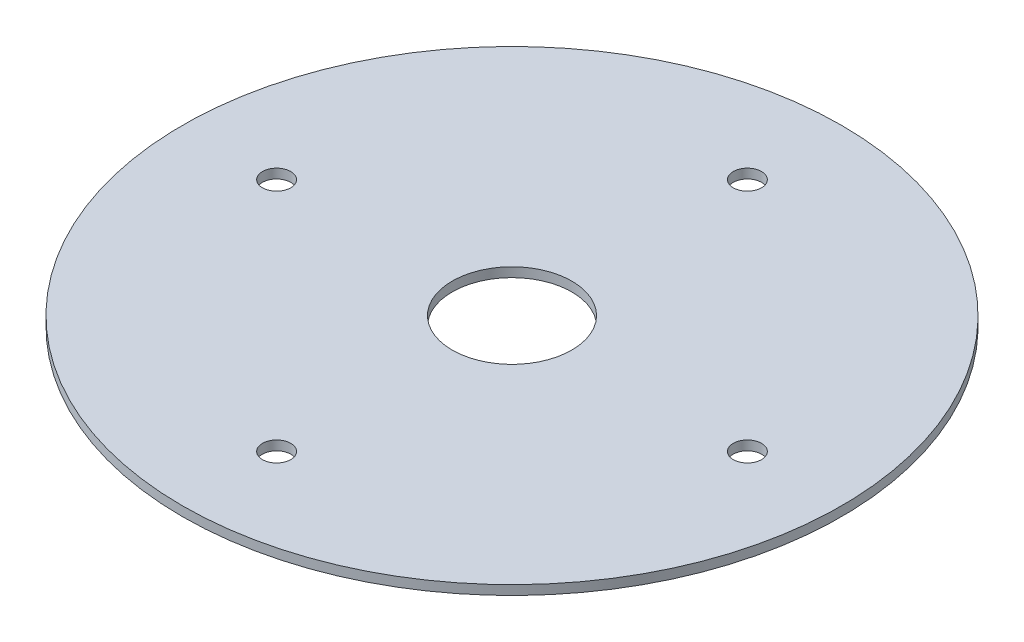
ISO-10303-21;
HEADER;
FILE_DESCRIPTION(('STEP AP214'),'2;1');
FILE_NAME('part.step','',(''),(''),'','','');
FILE_SCHEMA(('AUTOMOTIVE_DESIGN { 1 0 10303 214 1 1 1 1 }'));
ENDSEC;
DATA;
#1=APPLICATION_CONTEXT('core data for automotive mechanical design processes');
#2=APPLICATION_PROTOCOL_DEFINITION('international standard','automotive_design',2000,#1);
#3=PRODUCT_CONTEXT('',#1,'mechanical');
#4=PRODUCT('Part','Part','',(#3));
#5=PRODUCT_RELATED_PRODUCT_CATEGORY('part','',(#4));
#6=PRODUCT_DEFINITION_FORMATION('','',#4);
#7=PRODUCT_DEFINITION_CONTEXT('part definition',#1,'design');
#8=PRODUCT_DEFINITION('design','',#6,#7);
#9=PRODUCT_DEFINITION_SHAPE('','',#8);
#10=(LENGTH_UNIT() NAMED_UNIT(*) SI_UNIT(.MILLI.,.METRE.));
#11=(NAMED_UNIT(*) PLANE_ANGLE_UNIT() SI_UNIT($,.RADIAN.));
#12=(NAMED_UNIT(*) SI_UNIT($,.STERADIAN.) SOLID_ANGLE_UNIT());
#13=UNCERTAINTY_MEASURE_WITH_UNIT(LENGTH_MEASURE(1.E-05),#10,'distance_accuracy_value','');
#14=(GEOMETRIC_REPRESENTATION_CONTEXT(3) GLOBAL_UNCERTAINTY_ASSIGNED_CONTEXT((#13)) GLOBAL_UNIT_ASSIGNED_CONTEXT((#10,
#11,#12)) REPRESENTATION_CONTEXT('',''));
#15=CARTESIAN_POINT('',(0.,0.,0.));
#16=DIRECTION('',(0.,0.,1.));
#17=DIRECTION('',(1.,0.,0.));
#18=AXIS2_PLACEMENT_3D('',#15,#16,#17);
#19=CARTESIAN_POINT('',(0.,1.,0.));
#20=DIRECTION('',(0.,-1.,0.));
#21=DIRECTION('',(0.,0.,-1.));
#22=AXIS2_PLACEMENT_3D('',#19,#20,#21);
#23=CYLINDRICAL_SURFACE('',#22,35.);
#24=CARTESIAN_POINT('',(0.,1.,0.));
#25=DIRECTION('',(0.,1.,0.));
#26=DIRECTION('',(0.,0.,1.));
#27=AXIS2_PLACEMENT_3D('',#24,#25,#26);
#28=CIRCLE('',#27,35.);
#29=CARTESIAN_POINT('',(0.,1.,35.));
#30=VERTEX_POINT('',#29);
#31=EDGE_CURVE('E10',#30,#30,#28,.T.);
#32=ORIENTED_EDGE('',*,*,#31,.F.);
#33=EDGE_LOOP('',(#32));
#34=FACE_BOUND('',#33,.T.);
#35=CARTESIAN_POINT('',(0.,0.,0.));
#36=DIRECTION('',(0.,1.,0.));
#37=DIRECTION('',(0.,0.,1.));
#38=AXIS2_PLACEMENT_3D('',#35,#36,#37);
#39=CIRCLE('',#38,35.);
#40=CARTESIAN_POINT('',(0.,0.,35.));
#41=VERTEX_POINT('',#40);
#42=EDGE_CURVE('E44',#41,#41,#39,.T.);
#43=ORIENTED_EDGE('',*,*,#42,.T.);
#44=EDGE_LOOP('',(#43));
#45=FACE_BOUND('',#44,.T.);
#46=ADVANCED_FACE('F41',(#34,#45),#23,.T.);
#47=CARTESIAN_POINT('',(0.,1.,0.));
#48=DIRECTION('',(0.,1.,0.));
#49=DIRECTION('',(0.,0.,1.));
#50=AXIS2_PLACEMENT_3D('',#47,#48,#49);
#51=PLANE('',#50);
#52=CARTESIAN_POINT('',(25.,1.,0.));
#53=DIRECTION('',(0.,1.,0.));
#54=DIRECTION('',(-1.,0.,0.));
#55=AXIS2_PLACEMENT_3D('',#52,#53,#54);
#56=CIRCLE('',#55,1.5);
#57=CARTESIAN_POINT('',(23.5,1.,0.));
#58=VERTEX_POINT('',#57);
#59=EDGE_CURVE('E87',#58,#58,#56,.T.);
#60=ORIENTED_EDGE('',*,*,#59,.F.);
#61=EDGE_LOOP('',(#60));
#62=FACE_BOUND('',#61,.T.);
#63=CARTESIAN_POINT('',(0.,1.,25.));
#64=DIRECTION('',(0.,1.,0.));
#65=DIRECTION('',(0.,0.,-1.));
#66=AXIS2_PLACEMENT_3D('',#63,#64,#65);
#67=CIRCLE('',#66,1.5);
#68=CARTESIAN_POINT('',(0.,1.,23.5));
#69=VERTEX_POINT('',#68);
#70=EDGE_CURVE('E79',#69,#69,#67,.T.);
#71=ORIENTED_EDGE('',*,*,#70,.F.);
#72=EDGE_LOOP('',(#71));
#73=FACE_BOUND('',#72,.T.);
#74=CARTESIAN_POINT('',(-25.,1.,-2.61861100413235E-13));
#75=DIRECTION('',(0.,1.,0.));
#76=DIRECTION('',(1.,0.,0.));
#77=AXIS2_PLACEMENT_3D('',#74,#75,#76);
#78=CIRCLE('',#77,1.5);
#79=CARTESIAN_POINT('',(-23.5,1.,-2.46149434388441E-13));
#80=VERTEX_POINT('',#79);
#81=EDGE_CURVE('E71',#80,#80,#78,.T.);
#82=ORIENTED_EDGE('',*,*,#81,.F.);
#83=EDGE_LOOP('',(#82));
#84=FACE_BOUND('',#83,.T.);
#85=CARTESIAN_POINT('',(0.,1.,-25.));
#86=DIRECTION('',(0.,1.,0.));
#87=DIRECTION('',(0.,0.,1.));
#88=AXIS2_PLACEMENT_3D('',#85,#86,#87);
#89=CIRCLE('',#88,1.5);
#90=CARTESIAN_POINT('',(0.,1.,-23.5));
#91=VERTEX_POINT('',#90);
#92=EDGE_CURVE('E63',#91,#91,#89,.T.);
#93=ORIENTED_EDGE('',*,*,#92,.F.);
#94=EDGE_LOOP('',(#93));
#95=FACE_BOUND('',#94,.T.);
#96=CARTESIAN_POINT('',(0.,1.,0.));
#97=DIRECTION('',(0.,1.,0.));
#98=DIRECTION('',(0.,0.,1.));
#99=AXIS2_PLACEMENT_3D('',#96,#97,#98);
#100=CIRCLE('',#99,6.35);
#101=CARTESIAN_POINT('',(0.,1.,6.35));
#102=VERTEX_POINT('',#101);
#103=EDGE_CURVE('E55',#102,#102,#100,.T.);
#104=ORIENTED_EDGE('',*,*,#103,.F.);
#105=EDGE_LOOP('',(#104));
#106=FACE_BOUND('',#105,.T.);
#107=ORIENTED_EDGE('',*,*,#31,.T.);
#108=EDGE_LOOP('',(#107));
#109=FACE_BOUND('',#108,.T.);
#110=ADVANCED_FACE('F105',(#62,#73,#84,#95,#106,#109),#51,.T.);
#111=CARTESIAN_POINT('',(0.,0.,0.));
#112=DIRECTION('',(0.,1.,0.));
#113=DIRECTION('',(0.,0.,1.));
#114=AXIS2_PLACEMENT_3D('',#111,#112,#113);
#115=PLANE('',#114);
#116=CARTESIAN_POINT('',(25.,0.,0.));
#117=DIRECTION('',(0.,1.,0.));
#118=DIRECTION('',(-1.,0.,0.));
#119=AXIS2_PLACEMENT_3D('',#116,#117,#118);
#120=CIRCLE('',#119,1.5);
#121=CARTESIAN_POINT('',(23.5,0.,0.));
#122=VERTEX_POINT('',#121);
#123=EDGE_CURVE('E67',#122,#122,#120,.T.);
#124=ORIENTED_EDGE('',*,*,#123,.T.);
#125=EDGE_LOOP('',(#124));
#126=FACE_BOUND('',#125,.T.);
#127=CARTESIAN_POINT('',(0.,0.,25.));
#128=DIRECTION('',(0.,1.,0.));
#129=DIRECTION('',(0.,0.,-1.));
#130=AXIS2_PLACEMENT_3D('',#127,#128,#129);
#131=CIRCLE('',#130,1.5);
#132=CARTESIAN_POINT('',(0.,0.,23.5));
#133=VERTEX_POINT('',#132);
#134=EDGE_CURVE('E83',#133,#133,#131,.T.);
#135=ORIENTED_EDGE('',*,*,#134,.T.);
#136=EDGE_LOOP('',(#135));
#137=FACE_BOUND('',#136,.T.);
#138=CARTESIAN_POINT('',(-25.,0.,-2.61861100413235E-13));
#139=DIRECTION('',(0.,1.,0.));
#140=DIRECTION('',(1.,0.,0.));
#141=AXIS2_PLACEMENT_3D('',#138,#139,#140);
#142=CIRCLE('',#141,1.5);
#143=CARTESIAN_POINT('',(-23.5,0.,-2.46149434388441E-13));
#144=VERTEX_POINT('',#143);
#145=EDGE_CURVE('E75',#144,#144,#142,.T.);
#146=ORIENTED_EDGE('',*,*,#145,.T.);
#147=EDGE_LOOP('',(#146));
#148=FACE_BOUND('',#147,.T.);
#149=CARTESIAN_POINT('',(0.,0.,-25.));
#150=DIRECTION('',(0.,1.,0.));
#151=DIRECTION('',(0.,0.,1.));
#152=AXIS2_PLACEMENT_3D('',#149,#150,#151);
#153=CIRCLE('',#152,1.5);
#154=CARTESIAN_POINT('',(0.,0.,-23.5));
#155=VERTEX_POINT('',#154);
#156=EDGE_CURVE('E59',#155,#155,#153,.T.);
#157=ORIENTED_EDGE('',*,*,#156,.T.);
#158=EDGE_LOOP('',(#157));
#159=FACE_BOUND('',#158,.T.);
#160=CARTESIAN_POINT('',(0.,0.,0.));
#161=DIRECTION('',(0.,1.,0.));
#162=DIRECTION('',(0.,0.,1.));
#163=AXIS2_PLACEMENT_3D('',#160,#161,#162);
#164=CIRCLE('',#163,6.35);
#165=CARTESIAN_POINT('',(0.,0.,6.35));
#166=VERTEX_POINT('',#165);
#167=EDGE_CURVE('E53',#166,#166,#164,.T.);
#168=ORIENTED_EDGE('',*,*,#167,.T.);
#169=EDGE_LOOP('',(#168));
#170=FACE_BOUND('',#169,.T.);
#171=ORIENTED_EDGE('',*,*,#42,.F.);
#172=EDGE_LOOP('',(#171));
#173=FACE_BOUND('',#172,.T.);
#174=ADVANCED_FACE('F95',(#126,#137,#148,#159,#170,#173),#115,.F.);
#175=CARTESIAN_POINT('',(0.,0.,0.));
#176=DIRECTION('',(0.,1.,0.));
#177=DIRECTION('',(0.,0.,1.));
#178=AXIS2_PLACEMENT_3D('',#175,#176,#177);
#179=CYLINDRICAL_SURFACE('',#178,6.35);
#180=ORIENTED_EDGE('',*,*,#167,.F.);
#181=EDGE_LOOP('',(#180));
#182=FACE_BOUND('',#181,.T.);
#183=ORIENTED_EDGE('',*,*,#103,.T.);
#184=EDGE_LOOP('',(#183));
#185=FACE_BOUND('',#184,.T.);
#186=ADVANCED_FACE('F117',(#182,#185),#179,.F.);
#187=CARTESIAN_POINT('',(0.,0.,-25.));
#188=DIRECTION('',(0.,1.,0.));
#189=DIRECTION('',(0.,0.,1.));
#190=AXIS2_PLACEMENT_3D('',#187,#188,#189);
#191=CYLINDRICAL_SURFACE('',#190,1.5);
#192=ORIENTED_EDGE('',*,*,#156,.F.);
#193=EDGE_LOOP('',(#192));
#194=FACE_BOUND('',#193,.T.);
#195=ORIENTED_EDGE('',*,*,#92,.T.);
#196=EDGE_LOOP('',(#195));
#197=FACE_BOUND('',#196,.T.);
#198=ADVANCED_FACE('F119',(#194,#197),#191,.F.);
#199=CARTESIAN_POINT('',(-25.,0.,-2.61861100413235E-13));
#200=DIRECTION('',(0.,1.,0.));
#201=DIRECTION('',(0.,0.,1.));
#202=AXIS2_PLACEMENT_3D('',#199,#200,#201);
#203=CYLINDRICAL_SURFACE('',#202,1.5);
#204=ORIENTED_EDGE('',*,*,#145,.F.);
#205=EDGE_LOOP('',(#204));
#206=FACE_BOUND('',#205,.T.);
#207=ORIENTED_EDGE('',*,*,#81,.T.);
#208=EDGE_LOOP('',(#207));
#209=FACE_BOUND('',#208,.T.);
#210=ADVANCED_FACE('F126',(#206,#209),#203,.F.);
#211=CARTESIAN_POINT('',(0.,0.,25.));
#212=DIRECTION('',(0.,1.,0.));
#213=DIRECTION('',(0.,0.,1.));
#214=AXIS2_PLACEMENT_3D('',#211,#212,#213);
#215=CYLINDRICAL_SURFACE('',#214,1.5);
#216=ORIENTED_EDGE('',*,*,#134,.F.);
#217=EDGE_LOOP('',(#216));
#218=FACE_BOUND('',#217,.T.);
#219=ORIENTED_EDGE('',*,*,#70,.T.);
#220=EDGE_LOOP('',(#219));
#221=FACE_BOUND('',#220,.T.);
#222=ADVANCED_FACE('F101',(#218,#221),#215,.F.);
#223=CARTESIAN_POINT('',(25.,0.,0.));
#224=DIRECTION('',(0.,1.,0.));
#225=DIRECTION('',(0.,0.,1.));
#226=AXIS2_PLACEMENT_3D('',#223,#224,#225);
#227=CYLINDRICAL_SURFACE('',#226,1.5);
#228=ORIENTED_EDGE('',*,*,#123,.F.);
#229=EDGE_LOOP('',(#228));
#230=FACE_BOUND('',#229,.T.);
#231=ORIENTED_EDGE('',*,*,#59,.T.);
#232=EDGE_LOOP('',(#231));
#233=FACE_BOUND('',#232,.T.);
#234=ADVANCED_FACE('F98',(#230,#233),#227,.F.);
#235=CLOSED_SHELL('',(#46,#110,#174,#186,#198,#210,#222,#234));
#236=MANIFOLD_SOLID_BREP('B2',#235);
#237=ADVANCED_BREP_SHAPE_REPRESENTATION('',(#18,#236),#14);
#238=SHAPE_DEFINITION_REPRESENTATION(#9,#237);
ENDSEC;
END-ISO-10303-21;
